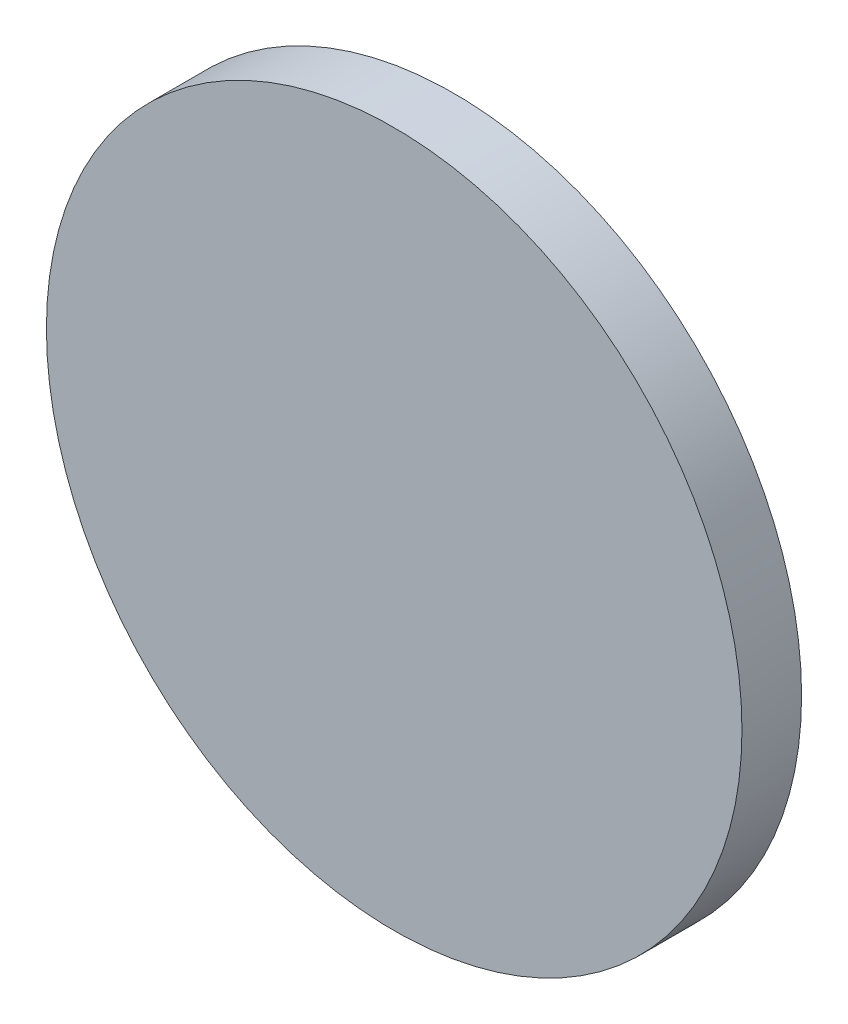
ISO-10303-21;
HEADER;
FILE_DESCRIPTION(('STEP AP214'),'2;1');
FILE_NAME('part.step','',(''),(''),'','','');
FILE_SCHEMA(('AUTOMOTIVE_DESIGN { 1 0 10303 214 1 1 1 1 }'));
ENDSEC;
DATA;
#1=APPLICATION_CONTEXT('core data for automotive mechanical design processes');
#2=APPLICATION_PROTOCOL_DEFINITION('international standard','automotive_design',2000,#1);
#3=PRODUCT_CONTEXT('',#1,'mechanical');
#4=PRODUCT('Part','Part','',(#3));
#5=PRODUCT_RELATED_PRODUCT_CATEGORY('part','',(#4));
#6=PRODUCT_DEFINITION_FORMATION('','',#4);
#7=PRODUCT_DEFINITION_CONTEXT('part definition',#1,'design');
#8=PRODUCT_DEFINITION('design','',#6,#7);
#9=PRODUCT_DEFINITION_SHAPE('','',#8);
#10=(LENGTH_UNIT() NAMED_UNIT(*) SI_UNIT(.MILLI.,.METRE.));
#11=(NAMED_UNIT(*) PLANE_ANGLE_UNIT() SI_UNIT($,.RADIAN.));
#12=(NAMED_UNIT(*) SI_UNIT($,.STERADIAN.) SOLID_ANGLE_UNIT());
#13=UNCERTAINTY_MEASURE_WITH_UNIT(LENGTH_MEASURE(1.E-05),#10,'distance_accuracy_value','');
#14=(GEOMETRIC_REPRESENTATION_CONTEXT(3) GLOBAL_UNCERTAINTY_ASSIGNED_CONTEXT((#13)) GLOBAL_UNIT_ASSIGNED_CONTEXT((#10,
#11,#12)) REPRESENTATION_CONTEXT('',''));
#15=CARTESIAN_POINT('',(0.,0.,0.));
#16=DIRECTION('',(0.,0.,1.));
#17=DIRECTION('',(1.,0.,0.));
#18=AXIS2_PLACEMENT_3D('',#15,#16,#17);
#19=CARTESIAN_POINT('',(3.69062,5.674360006176,0.03429));
#20=DIRECTION('',(0.,0.,1.));
#21=DIRECTION('',(1.,0.,0.));
#22=AXIS2_PLACEMENT_3D('',#19,#20,#21);
#23=PLANE('',#22);
#24=CARTESIAN_POINT('',(3.69062,5.674360006176,0.03429));
#25=DIRECTION('',(0.,0.,1.));
#26=DIRECTION('',(1.,0.,0.));
#27=AXIS2_PLACEMENT_3D('',#24,#25,#26);
#28=CIRCLE('',#27,0.200024667);
#29=CARTESIAN_POINT('',(3.890644667,5.674360006176,0.03429));
#30=VERTEX_POINT('',#29);
#31=EDGE_CURVE('E18',#30,#30,#28,.F.);
#32=ORIENTED_EDGE('',*,*,#31,.F.);
#33=EDGE_LOOP('',(#32));
#34=FACE_BOUND('',#33,.T.);
#35=ADVANCED_FACE('F15',(#34),#23,.T.);
#36=CARTESIAN_POINT('',(3.69062,5.674360006176,0.));
#37=DIRECTION('',(0.,0.,1.));
#38=DIRECTION('',(1.,0.,0.));
#39=AXIS2_PLACEMENT_3D('',#36,#37,#38);
#40=CYLINDRICAL_SURFACE('',#39,0.200024667);
#41=ORIENTED_EDGE('',*,*,#31,.T.);
#42=EDGE_LOOP('',(#41));
#43=FACE_BOUND('',#42,.T.);
#44=CARTESIAN_POINT('',(3.69062,5.674360006176,0.));
#45=DIRECTION('',(0.,0.,1.));
#46=DIRECTION('',(1.,0.,0.));
#47=AXIS2_PLACEMENT_3D('',#44,#45,#46);
#48=CIRCLE('',#47,0.200024667);
#49=CARTESIAN_POINT('',(3.890644667,5.674360006176,0.));
#50=VERTEX_POINT('',#49);
#51=EDGE_CURVE('E10',#50,#50,#48,.F.);
#52=ORIENTED_EDGE('',*,*,#51,.F.);
#53=EDGE_LOOP('',(#52));
#54=FACE_BOUND('',#53,.T.);
#55=ADVANCED_FACE('F27',(#43,#54),#40,.T.);
#56=CARTESIAN_POINT('',(3.69062,5.674360006176,0.));
#57=DIRECTION('',(0.,0.,-1.));
#58=DIRECTION('',(-1.,0.,0.));
#59=AXIS2_PLACEMENT_3D('',#56,#57,#58);
#60=PLANE('',#59);
#61=ORIENTED_EDGE('',*,*,#51,.T.);
#62=EDGE_LOOP('',(#61));
#63=FACE_BOUND('',#62,.T.);
#64=ADVANCED_FACE('F35',(#63),#60,.T.);
#65=CLOSED_SHELL('',(#35,#55,#64));
#66=MANIFOLD_SOLID_BREP('B1',#65);
#67=ADVANCED_BREP_SHAPE_REPRESENTATION('',(#18,#66),#14);
#68=SHAPE_DEFINITION_REPRESENTATION(#9,#67);
ENDSEC;
END-ISO-10303-21;
